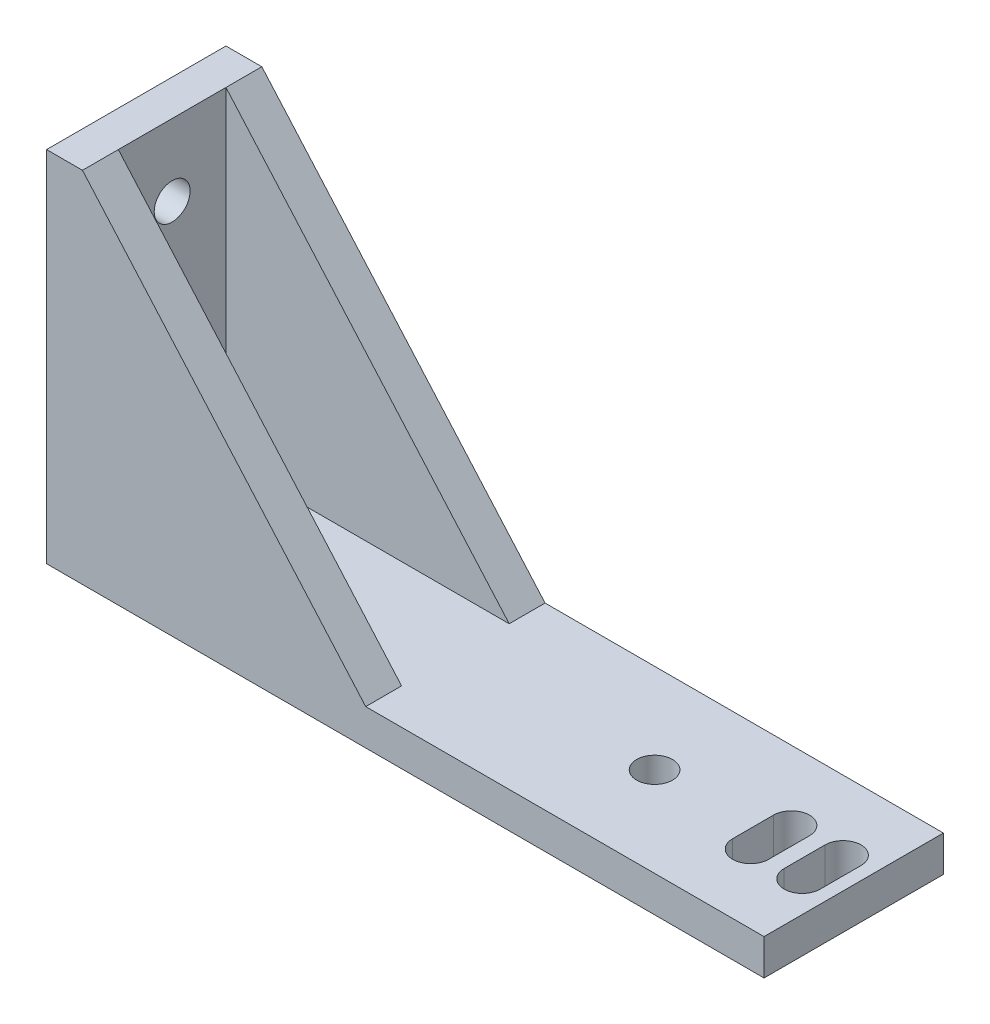
ISO-10303-21;
HEADER;
FILE_DESCRIPTION(('STEP AP214'),'2;1');
FILE_NAME('part.step','',(''),(''),'','','');
FILE_SCHEMA(('AUTOMOTIVE_DESIGN { 1 0 10303 214 1 1 1 1 }'));
ENDSEC;
DATA;
#1=APPLICATION_CONTEXT('core data for automotive mechanical design processes');
#2=APPLICATION_PROTOCOL_DEFINITION('international standard','automotive_design',2000,#1);
#3=PRODUCT_CONTEXT('',#1,'mechanical');
#4=PRODUCT('Part','Part','',(#3));
#5=PRODUCT_RELATED_PRODUCT_CATEGORY('part','',(#4));
#6=PRODUCT_DEFINITION_FORMATION('','',#4);
#7=PRODUCT_DEFINITION_CONTEXT('part definition',#1,'design');
#8=PRODUCT_DEFINITION('design','',#6,#7);
#9=PRODUCT_DEFINITION_SHAPE('','',#8);
#10=(LENGTH_UNIT() NAMED_UNIT(*) SI_UNIT(.MILLI.,.METRE.));
#11=(NAMED_UNIT(*) PLANE_ANGLE_UNIT() SI_UNIT($,.RADIAN.));
#12=(NAMED_UNIT(*) SI_UNIT($,.STERADIAN.) SOLID_ANGLE_UNIT());
#13=UNCERTAINTY_MEASURE_WITH_UNIT(LENGTH_MEASURE(1.E-05),#10,'distance_accuracy_value','');
#14=(GEOMETRIC_REPRESENTATION_CONTEXT(3) GLOBAL_UNCERTAINTY_ASSIGNED_CONTEXT((#13)) GLOBAL_UNIT_ASSIGNED_CONTEXT((#10,
#11,#12)) REPRESENTATION_CONTEXT('',''));
#15=CARTESIAN_POINT('',(0.,0.,0.));
#16=DIRECTION('',(0.,0.,1.));
#17=DIRECTION('',(1.,0.,0.));
#18=AXIS2_PLACEMENT_3D('',#15,#16,#17);
#19=CARTESIAN_POINT('',(0.,0.,0.));
#20=DIRECTION('',(0.,1.,0.));
#21=DIRECTION('',(0.,0.,1.));
#22=AXIS2_PLACEMENT_3D('',#19,#20,#21);
#23=PLANE('',#22);
#24=DIRECTION('',(0.,0.,1.));
#25=VECTOR('',#24,1.);
#26=CARTESIAN_POINT('',(-53.3411919695212,0.,-17.033232323834));
#27=LINE('',#26,#25);
#28=CARTESIAN_POINT('',(-53.3411919695212,0.,-22.033232323834));
#29=VERTEX_POINT('',#28);
#30=CARTESIAN_POINT('',(-53.3411919695212,0.,2.96676767616603));
#31=VERTEX_POINT('',#30);
#32=EDGE_CURVE('E483',#29,#31,#27,.T.);
#33=ORIENTED_EDGE('',*,*,#32,.F.);
#34=DIRECTION('',(1.,0.,0.));
#35=VECTOR('',#34,1.);
#36=CARTESIAN_POINT('',(0.,0.,-22.033232323834));
#37=LINE('',#36,#35);
#38=CARTESIAN_POINT('',(46.6588080304788,0.,-22.033232323834));
#39=VERTEX_POINT('',#38);
#40=EDGE_CURVE('E453',#29,#39,#37,.T.);
#41=ORIENTED_EDGE('',*,*,#40,.T.);
#42=DIRECTION('',(0.,0.,-1.));
#43=VECTOR('',#42,1.);
#44=CARTESIAN_POINT('',(46.6588080304788,0.,-17.033232323834));
#45=LINE('',#44,#43);
#46=CARTESIAN_POINT('',(46.6588080304788,0.,2.96676767616603));
#47=VERTEX_POINT('',#46);
#48=EDGE_CURVE('E489',#47,#39,#45,.T.);
#49=ORIENTED_EDGE('',*,*,#48,.F.);
#50=DIRECTION('',(-1.,0.,0.));
#51=VECTOR('',#50,1.);
#52=CARTESIAN_POINT('',(0.,0.,2.96676767616603));
#53=LINE('',#52,#51);
#54=EDGE_CURVE('E437',#47,#31,#53,.T.);
#55=ORIENTED_EDGE('',*,*,#54,.T.);
#56=EDGE_LOOP('',(#33,#41,#49,#55));
#57=FACE_BOUND('',#56,.T.);
#58=CARTESIAN_POINT('',(18.8988080304788,0.,-9.53323232383397));
#59=DIRECTION('',(0.,1.,0.));
#60=DIRECTION('',(0.,0.,1.));
#61=AXIS2_PLACEMENT_3D('',#58,#59,#60);
#62=CIRCLE('',#61,2.49999999999999);
#63=CARTESIAN_POINT('',(18.8988080304788,0.,-7.03323232383398));
#64=VERTEX_POINT('',#63);
#65=EDGE_CURVE('E364',#64,#64,#62,.T.);
#66=ORIENTED_EDGE('',*,*,#65,.T.);
#67=EDGE_LOOP('',(#66));
#68=FACE_BOUND('',#67,.T.);
#69=CARTESIAN_POINT('',(42.3428128183478,0.,-12.3591779417885));
#70=DIRECTION('',(0.,1.,0.));
#71=DIRECTION('',(0.,0.,1.));
#72=AXIS2_PLACEMENT_3D('',#69,#70,#71);
#73=CIRCLE('',#72,2.5);
#74=CARTESIAN_POINT('',(44.8428128183478,0.,-12.3591779417885));
#75=VERTEX_POINT('',#74);
#76=CARTESIAN_POINT('',(39.8428128183478,0.,-12.3591779417885));
#77=VERTEX_POINT('',#76);
#78=EDGE_CURVE('E507',#75,#77,#73,.T.);
#79=ORIENTED_EDGE('',*,*,#78,.T.);
#80=DIRECTION('',(0.,0.,1.));
#81=VECTOR('',#80,1.);
#82=CARTESIAN_POINT('',(39.8428128183478,0.,0.));
#83=LINE('',#82,#81);
#84=CARTESIAN_POINT('',(39.8428128183478,0.,-6.65917794178849));
#85=VERTEX_POINT('',#84);
#86=EDGE_CURVE('E511',#77,#85,#83,.T.);
#87=ORIENTED_EDGE('',*,*,#86,.T.);
#88=CARTESIAN_POINT('',(42.3428128183478,0.,-6.65917794178849));
#89=DIRECTION('',(0.,1.,0.));
#90=DIRECTION('',(0.,0.,1.));
#91=AXIS2_PLACEMENT_3D('',#88,#89,#90);
#92=CIRCLE('',#91,2.5);
#93=CARTESIAN_POINT('',(44.8428128183478,0.,-6.65917794178849));
#94=VERTEX_POINT('',#93);
#95=EDGE_CURVE('E503',#85,#94,#92,.T.);
#96=ORIENTED_EDGE('',*,*,#95,.T.);
#97=DIRECTION('',(0.,0.,-1.));
#98=VECTOR('',#97,1.);
#99=CARTESIAN_POINT('',(44.8428128183478,0.,-1.09178779122557E-13));
#100=LINE('',#99,#98);
#101=EDGE_CURVE('E495',#94,#75,#100,.T.);
#102=ORIENTED_EDGE('',*,*,#101,.T.);
#103=EDGE_LOOP('',(#79,#87,#96,#102));
#104=FACE_BOUND('',#103,.T.);
#105=DIRECTION('',(0.,0.,-1.));
#106=VECTOR('',#105,1.);
#107=CARTESIAN_POINT('',(32.6546149792119,0.,-6.66475158001632));
#108=LINE('',#107,#106);
#109=CARTESIAN_POINT('',(32.654614979212,0.,-6.66475158001632));
#110=VERTEX_POINT('',#109);
#111=CARTESIAN_POINT('',(32.654614979212,0.,-12.3647515800163));
#112=VERTEX_POINT('',#111);
#113=EDGE_CURVE('E384',#110,#112,#108,.T.);
#114=ORIENTED_EDGE('',*,*,#113,.F.);
#115=CARTESIAN_POINT('',(35.154614979212,0.,-6.66475158001631));
#116=DIRECTION('',(0.,-1.,0.));
#117=DIRECTION('',(0.,0.,-1.));
#118=AXIS2_PLACEMENT_3D('',#115,#116,#117);
#119=CIRCLE('',#118,2.49999999999999);
#120=CARTESIAN_POINT('',(37.6546149792119,0.,-6.66475158001631));
#121=VERTEX_POINT('',#120);
#122=EDGE_CURVE('E393',#121,#110,#119,.T.);
#123=ORIENTED_EDGE('',*,*,#122,.F.);
#124=DIRECTION('',(0.,0.,-1.));
#125=VECTOR('',#124,1.);
#126=CARTESIAN_POINT('',(37.6546149792119,0.,-6.66475158001631));
#127=LINE('',#126,#125);
#128=CARTESIAN_POINT('',(37.654614979212,0.,-12.3647515800163));
#129=VERTEX_POINT('',#128);
#130=EDGE_CURVE('E387',#121,#129,#127,.T.);
#131=ORIENTED_EDGE('',*,*,#130,.T.);
#132=CARTESIAN_POINT('',(35.154614979212,0.,-12.3647515800163));
#133=DIRECTION('',(0.,-1.,0.));
#134=DIRECTION('',(0.,0.,-1.));
#135=AXIS2_PLACEMENT_3D('',#132,#133,#134);
#136=CIRCLE('',#135,2.49999999999999);
#137=EDGE_CURVE('E402',#112,#129,#136,.T.);
#138=ORIENTED_EDGE('',*,*,#137,.F.);
#139=EDGE_LOOP('',(#114,#123,#131,#138));
#140=FACE_BOUND('',#139,.T.);
#141=ADVANCED_FACE('F189',(#57,#68,#104,#140),#23,.F.);
#142=CARTESIAN_POINT('',(0.,5.,0.));
#143=DIRECTION('',(0.,1.,0.));
#144=DIRECTION('',(0.,0.,1.));
#145=AXIS2_PLACEMENT_3D('',#142,#143,#144);
#146=PLANE('',#145);
#147=CARTESIAN_POINT('',(18.8988080304788,5.,-9.53323232383397));
#148=DIRECTION('',(0.,1.,0.));
#149=DIRECTION('',(0.,0.,1.));
#150=AXIS2_PLACEMENT_3D('',#147,#148,#149);
#151=CIRCLE('',#150,2.49999999999999);
#152=CARTESIAN_POINT('',(18.8988080304788,5.,-7.03323232383398));
#153=VERTEX_POINT('',#152);
#154=EDGE_CURVE('E360',#153,#153,#151,.T.);
#155=ORIENTED_EDGE('',*,*,#154,.F.);
#156=EDGE_LOOP('',(#155));
#157=FACE_BOUND('',#156,.T.);
#158=DIRECTION('',(0.,0.,-1.));
#159=VECTOR('',#158,1.);
#160=CARTESIAN_POINT('',(44.8428128183478,5.,-6.6591779417885));
#161=LINE('',#160,#159);
#162=CARTESIAN_POINT('',(44.8428128183478,5.,-6.65917794178849));
#163=VERTEX_POINT('',#162);
#164=CARTESIAN_POINT('',(44.8428128183478,5.,-12.3591779417885));
#165=VERTEX_POINT('',#164);
#166=EDGE_CURVE('E409',#163,#165,#161,.T.);
#167=ORIENTED_EDGE('',*,*,#166,.F.);
#168=CARTESIAN_POINT('',(42.3428128183478,5.,-6.65917794178849));
#169=DIRECTION('',(0.,1.,0.));
#170=DIRECTION('',(0.,0.,1.));
#171=AXIS2_PLACEMENT_3D('',#168,#169,#170);
#172=CIRCLE('',#171,2.49999999999999);
#173=CARTESIAN_POINT('',(39.8428128183477,5.,-6.65917794178849));
#174=VERTEX_POINT('',#173);
#175=EDGE_CURVE('E419',#174,#163,#172,.T.);
#176=ORIENTED_EDGE('',*,*,#175,.F.);
#177=DIRECTION('',(0.,0.,-1.));
#178=VECTOR('',#177,1.);
#179=CARTESIAN_POINT('',(39.8428128183478,5.,-6.65917794178849));
#180=LINE('',#179,#178);
#181=CARTESIAN_POINT('',(39.8428128183478,5.,-12.3591779417885));
#182=VERTEX_POINT('',#181);
#183=EDGE_CURVE('E412',#174,#182,#180,.T.);
#184=ORIENTED_EDGE('',*,*,#183,.T.);
#185=CARTESIAN_POINT('',(42.3428128183478,5.,-12.3591779417885));
#186=DIRECTION('',(0.,1.,0.));
#187=DIRECTION('',(0.,0.,1.));
#188=AXIS2_PLACEMENT_3D('',#185,#186,#187);
#189=CIRCLE('',#188,2.49999999999999);
#190=EDGE_CURVE('E430',#165,#182,#189,.T.);
#191=ORIENTED_EDGE('',*,*,#190,.F.);
#192=EDGE_LOOP('',(#167,#176,#184,#191));
#193=FACE_BOUND('',#192,.T.);
#194=DIRECTION('',(0.,0.,-1.));
#195=VECTOR('',#194,1.);
#196=CARTESIAN_POINT('',(-48.3411919695212,5.,-17.033232323834));
#197=LINE('',#196,#195);
#198=CARTESIAN_POINT('',(-48.3411919695212,5.,-2.03323232383397));
#199=VERTEX_POINT('',#198);
#200=CARTESIAN_POINT('',(-48.3411919695212,5.,-17.033232323834));
#201=VERTEX_POINT('',#200);
#202=EDGE_CURVE('E466',#199,#201,#197,.T.);
#203=ORIENTED_EDGE('',*,*,#202,.F.);
#204=DIRECTION('',(1.,0.,0.));
#205=VECTOR('',#204,1.);
#206=CARTESIAN_POINT('',(-53.3411919695212,5.,-2.03323232383397));
#207=LINE('',#206,#205);
#208=CARTESIAN_POINT('',(-8.86119196952119,5.,-2.03323232383397));
#209=VERTEX_POINT('',#208);
#210=EDGE_CURVE('E484',#199,#209,#207,.T.);
#211=ORIENTED_EDGE('',*,*,#210,.T.);
#212=DIRECTION('',(0.,0.,1.));
#213=VECTOR('',#212,1.);
#214=CARTESIAN_POINT('',(-8.86119196952119,5.,0.));
#215=LINE('',#214,#213);
#216=CARTESIAN_POINT('',(-8.86119196952119,5.,2.96676767616603));
#217=VERTEX_POINT('',#216);
#218=EDGE_CURVE('E442',#209,#217,#215,.T.);
#219=ORIENTED_EDGE('',*,*,#218,.T.);
#220=DIRECTION('',(-1.,0.,0.));
#221=VECTOR('',#220,1.);
#222=CARTESIAN_POINT('',(0.,5.,2.96676767616603));
#223=LINE('',#222,#221);
#224=CARTESIAN_POINT('',(46.6588080304788,5.,2.96676767616603));
#225=VERTEX_POINT('',#224);
#226=EDGE_CURVE('E438',#225,#217,#223,.T.);
#227=ORIENTED_EDGE('',*,*,#226,.F.);
#228=DIRECTION('',(0.,0.,-1.));
#229=VECTOR('',#228,1.);
#230=CARTESIAN_POINT('',(46.6588080304788,5.,-17.033232323834));
#231=LINE('',#230,#229);
#232=CARTESIAN_POINT('',(46.6588080304788,5.,-22.033232323834));
#233=VERTEX_POINT('',#232);
#234=EDGE_CURVE('E488',#225,#233,#231,.T.);
#235=ORIENTED_EDGE('',*,*,#234,.T.);
#236=DIRECTION('',(1.,0.,0.));
#237=VECTOR('',#236,1.);
#238=CARTESIAN_POINT('',(0.,5.,-22.033232323834));
#239=LINE('',#238,#237);
#240=CARTESIAN_POINT('',(-8.86119196952119,5.,-22.033232323834));
#241=VERTEX_POINT('',#240);
#242=EDGE_CURVE('E454',#241,#233,#239,.T.);
#243=ORIENTED_EDGE('',*,*,#242,.F.);
#244=DIRECTION('',(0.,0.,-1.));
#245=VECTOR('',#244,1.);
#246=CARTESIAN_POINT('',(-8.86119196952118,5.,0.));
#247=LINE('',#246,#245);
#248=CARTESIAN_POINT('',(-8.86119196952119,5.,-17.033232323834));
#249=VERTEX_POINT('',#248);
#250=EDGE_CURVE('E315',#249,#241,#247,.T.);
#251=ORIENTED_EDGE('',*,*,#250,.F.);
#252=DIRECTION('',(-1.,0.,0.));
#253=VECTOR('',#252,1.);
#254=CARTESIAN_POINT('',(-53.3411919695212,5.,-17.033232323834));
#255=LINE('',#254,#253);
#256=EDGE_CURVE('E492',#249,#201,#255,.T.);
#257=ORIENTED_EDGE('',*,*,#256,.T.);
#258=EDGE_LOOP('',(#203,#211,#219,#227,#235,#243,#251,#257));
#259=FACE_BOUND('',#258,.T.);
#260=CARTESIAN_POINT('',(35.154614979212,5.,-12.3647515800163));
#261=DIRECTION('',(0.,1.,0.));
#262=DIRECTION('',(0.,0.,1.));
#263=AXIS2_PLACEMENT_3D('',#260,#261,#262);
#264=CIRCLE('',#263,2.5);
#265=CARTESIAN_POINT('',(37.654614979212,5.,-12.3647515800163));
#266=VERTEX_POINT('',#265);
#267=CARTESIAN_POINT('',(32.654614979212,5.,-12.3647515800163));
#268=VERTEX_POINT('',#267);
#269=EDGE_CURVE('E198',#266,#268,#264,.T.);
#270=ORIENTED_EDGE('',*,*,#269,.F.);
#271=DIRECTION('',(0.,0.,1.));
#272=VECTOR('',#271,1.);
#273=CARTESIAN_POINT('',(37.6546149792119,5.,0.));
#274=LINE('',#273,#272);
#275=CARTESIAN_POINT('',(37.654614979212,5.,-6.66475158001631));
#276=VERTEX_POINT('',#275);
#277=EDGE_CURVE('E13',#266,#276,#274,.T.);
#278=ORIENTED_EDGE('',*,*,#277,.T.);
#279=CARTESIAN_POINT('',(35.154614979212,5.,-6.66475158001631));
#280=DIRECTION('',(0.,1.,0.));
#281=DIRECTION('',(0.,0.,1.));
#282=AXIS2_PLACEMENT_3D('',#279,#280,#281);
#283=CIRCLE('',#282,2.5);
#284=CARTESIAN_POINT('',(32.654614979212,5.,-6.66475158001632));
#285=VERTEX_POINT('',#284);
#286=EDGE_CURVE('E518',#285,#276,#283,.T.);
#287=ORIENTED_EDGE('',*,*,#286,.F.);
#288=DIRECTION('',(0.,0.,1.));
#289=VECTOR('',#288,1.);
#290=CARTESIAN_POINT('',(32.6546149792119,5.,0.));
#291=LINE('',#290,#289);
#292=EDGE_CURVE('E515',#268,#285,#291,.T.);
#293=ORIENTED_EDGE('',*,*,#292,.F.);
#294=EDGE_LOOP('',(#270,#278,#287,#293));
#295=FACE_BOUND('',#294,.T.);
#296=ADVANCED_FACE('F533',(#157,#193,#259,#295),#146,.T.);
#297=CARTESIAN_POINT('',(-53.3411919695212,5.,-17.033232323834));
#298=DIRECTION('',(1.,0.,0.));
#299=DIRECTION('',(0.,0.,-1.));
#300=AXIS2_PLACEMENT_3D('',#297,#298,#299);
#301=PLANE('',#300);
#302=CARTESIAN_POINT('',(-53.3411919695212,40.,-9.53323232383397));
#303=DIRECTION('',(-1.,0.,0.));
#304=DIRECTION('',(0.,0.,1.));
#305=AXIS2_PLACEMENT_3D('',#302,#303,#304);
#306=CIRCLE('',#305,2.49999999999999);
#307=CARTESIAN_POINT('',(-53.3411919695212,40.,-7.03323232383398));
#308=VERTEX_POINT('',#307);
#309=EDGE_CURVE('E368',#308,#308,#306,.T.);
#310=ORIENTED_EDGE('',*,*,#309,.F.);
#311=EDGE_LOOP('',(#310));
#312=FACE_BOUND('',#311,.T.);
#313=CARTESIAN_POINT('',(-53.3411919695212,14.9999999999998,-9.95857778879027));
#314=DIRECTION('',(-1.,0.,0.));
#315=DIRECTION('',(0.,0.,1.));
#316=AXIS2_PLACEMENT_3D('',#313,#314,#315);
#317=CIRCLE('',#316,2.49999999999999);
#318=CARTESIAN_POINT('',(-53.3411919695212,14.9999999999998,-7.45857778879028));
#319=VERTEX_POINT('',#318);
#320=EDGE_CURVE('E376',#319,#319,#317,.T.);
#321=ORIENTED_EDGE('',*,*,#320,.F.);
#322=EDGE_LOOP('',(#321));
#323=FACE_BOUND('',#322,.T.);
#324=ORIENTED_EDGE('',*,*,#32,.T.);
#325=DIRECTION('',(0.,-1.,0.));
#326=VECTOR('',#325,1.);
#327=CARTESIAN_POINT('',(-53.3411919695212,0.,2.96676767616603));
#328=LINE('',#327,#326);
#329=CARTESIAN_POINT('',(-53.3411919695212,50.,2.96676767616603));
#330=VERTEX_POINT('',#329);
#331=EDGE_CURVE('E350',#330,#31,#328,.T.);
#332=ORIENTED_EDGE('',*,*,#331,.F.);
#333=DIRECTION('',(0.,0.,1.));
#334=VECTOR('',#333,1.);
#335=CARTESIAN_POINT('',(-53.3411919695212,50.,-17.033232323834));
#336=LINE('',#335,#334);
#337=CARTESIAN_POINT('',(-53.3411919695212,50.,-22.033232323834));
#338=VERTEX_POINT('',#337);
#339=EDGE_CURVE('E467',#338,#330,#336,.T.);
#340=ORIENTED_EDGE('',*,*,#339,.F.);
#341=DIRECTION('',(0.,1.,0.));
#342=VECTOR('',#341,1.);
#343=CARTESIAN_POINT('',(-53.3411919695212,0.,-22.033232323834));
#344=LINE('',#343,#342);
#345=EDGE_CURVE('E319',#29,#338,#344,.T.);
#346=ORIENTED_EDGE('',*,*,#345,.F.);
#347=EDGE_LOOP('',(#324,#332,#340,#346));
#348=FACE_BOUND('',#347,.T.);
#349=ADVANCED_FACE('F191',(#312,#323,#348),#301,.F.);
#350=CARTESIAN_POINT('',(46.6588080304788,5.,-17.033232323834));
#351=DIRECTION('',(-1.,0.,0.));
#352=DIRECTION('',(0.,0.,1.));
#353=AXIS2_PLACEMENT_3D('',#350,#351,#352);
#354=PLANE('',#353);
#355=ORIENTED_EDGE('',*,*,#48,.T.);
#356=DIRECTION('',(0.,-1.,0.));
#357=VECTOR('',#356,1.);
#358=CARTESIAN_POINT('',(46.6588080304788,5.,-22.033232323834));
#359=LINE('',#358,#357);
#360=EDGE_CURVE('E459',#233,#39,#359,.T.);
#361=ORIENTED_EDGE('',*,*,#360,.F.);
#362=ORIENTED_EDGE('',*,*,#234,.F.);
#363=DIRECTION('',(0.,-1.,0.));
#364=VECTOR('',#363,1.);
#365=CARTESIAN_POINT('',(46.6588080304788,5.,2.96676767616603));
#366=LINE('',#365,#364);
#367=EDGE_CURVE('E446',#225,#47,#366,.T.);
#368=ORIENTED_EDGE('',*,*,#367,.T.);
#369=EDGE_LOOP('',(#355,#361,#362,#368));
#370=FACE_BOUND('',#369,.T.);
#371=ADVANCED_FACE('F549',(#370),#354,.F.);
#372=CARTESIAN_POINT('',(-48.3411919695212,50.,-17.033232323834));
#373=DIRECTION('',(-1.,0.,0.));
#374=DIRECTION('',(0.,0.,1.));
#375=AXIS2_PLACEMENT_3D('',#372,#373,#374);
#376=PLANE('',#375);
#377=CARTESIAN_POINT('',(-48.3411919695212,40.,-9.53323232383397));
#378=DIRECTION('',(-1.,0.,0.));
#379=DIRECTION('',(0.,0.,1.));
#380=AXIS2_PLACEMENT_3D('',#377,#378,#379);
#381=CIRCLE('',#380,2.5);
#382=CARTESIAN_POINT('',(-48.3411919695212,40.,-7.03323232383397));
#383=VERTEX_POINT('',#382);
#384=EDGE_CURVE('E372',#383,#383,#381,.T.);
#385=ORIENTED_EDGE('',*,*,#384,.T.);
#386=EDGE_LOOP('',(#385));
#387=FACE_BOUND('',#386,.T.);
#388=CARTESIAN_POINT('',(-48.3411919695212,14.9999999999998,-9.95857778879027));
#389=DIRECTION('',(-1.,0.,0.));
#390=DIRECTION('',(0.,0.,1.));
#391=AXIS2_PLACEMENT_3D('',#388,#389,#390);
#392=CIRCLE('',#391,2.49999999999999);
#393=CARTESIAN_POINT('',(-48.3411919695212,14.9999999999998,-7.45857778879028));
#394=VERTEX_POINT('',#393);
#395=EDGE_CURVE('E380',#394,#394,#392,.T.);
#396=ORIENTED_EDGE('',*,*,#395,.T.);
#397=EDGE_LOOP('',(#396));
#398=FACE_BOUND('',#397,.T.);
#399=ORIENTED_EDGE('',*,*,#202,.T.);
#400=DIRECTION('',(0.,-1.,0.));
#401=VECTOR('',#400,1.);
#402=CARTESIAN_POINT('',(-48.3411919695212,50.,-17.033232323834));
#403=LINE('',#402,#401);
#404=CARTESIAN_POINT('',(-48.3411919695212,50.,-17.033232323834));
#405=VERTEX_POINT('',#404);
#406=EDGE_CURVE('E472',#405,#201,#403,.T.);
#407=ORIENTED_EDGE('',*,*,#406,.F.);
#408=DIRECTION('',(0.,0.,-1.));
#409=VECTOR('',#408,1.);
#410=CARTESIAN_POINT('',(-48.3411919695212,50.,-17.033232323834));
#411=LINE('',#410,#409);
#412=CARTESIAN_POINT('',(-48.3411919695212,50.,-2.03323232383397));
#413=VERTEX_POINT('',#412);
#414=EDGE_CURVE('E334',#413,#405,#411,.T.);
#415=ORIENTED_EDGE('',*,*,#414,.F.);
#416=DIRECTION('',(0.,-1.,0.));
#417=VECTOR('',#416,1.);
#418=CARTESIAN_POINT('',(-48.3411919695212,50.,-2.03323232383397));
#419=LINE('',#418,#417);
#420=EDGE_CURVE('E479',#413,#199,#419,.T.);
#421=ORIENTED_EDGE('',*,*,#420,.T.);
#422=EDGE_LOOP('',(#399,#407,#415,#421));
#423=FACE_BOUND('',#422,.T.);
#424=ADVANCED_FACE('F551',(#387,#398,#423),#376,.F.);
#425=CARTESIAN_POINT('',(0.,50.,0.));
#426=DIRECTION('',(0.,1.,0.));
#427=DIRECTION('',(0.,0.,1.));
#428=AXIS2_PLACEMENT_3D('',#425,#426,#427);
#429=PLANE('',#428);
#430=ORIENTED_EDGE('',*,*,#339,.T.);
#431=DIRECTION('',(-1.,0.,0.));
#432=VECTOR('',#431,1.);
#433=CARTESIAN_POINT('',(-53.3411919695212,50.,2.96676767616603));
#434=LINE('',#433,#432);
#435=CARTESIAN_POINT('',(-48.3411919695212,50.,2.96676767616603));
#436=VERTEX_POINT('',#435);
#437=EDGE_CURVE('E342',#436,#330,#434,.T.);
#438=ORIENTED_EDGE('',*,*,#437,.F.);
#439=DIRECTION('',(0.,0.,-1.));
#440=VECTOR('',#439,1.);
#441=CARTESIAN_POINT('',(-48.3411919695212,50.,2.96676767616603));
#442=LINE('',#441,#440);
#443=EDGE_CURVE('E356',#436,#413,#442,.T.);
#444=ORIENTED_EDGE('',*,*,#443,.T.);
#445=ORIENTED_EDGE('',*,*,#414,.T.);
#446=DIRECTION('',(0.,0.,1.));
#447=VECTOR('',#446,1.);
#448=CARTESIAN_POINT('',(-48.3411919695212,50.,-22.033232323834));
#449=LINE('',#448,#447);
#450=CARTESIAN_POINT('',(-48.3411919695212,50.,-22.033232323834));
#451=VERTEX_POINT('',#450);
#452=EDGE_CURVE('E314',#451,#405,#449,.T.);
#453=ORIENTED_EDGE('',*,*,#452,.F.);
#454=DIRECTION('',(1.,0.,0.));
#455=VECTOR('',#454,1.);
#456=CARTESIAN_POINT('',(-53.3411919695212,50.,-22.033232323834));
#457=LINE('',#456,#455);
#458=EDGE_CURVE('E320',#338,#451,#457,.T.);
#459=ORIENTED_EDGE('',*,*,#458,.F.);
#460=EDGE_LOOP('',(#430,#438,#444,#445,#453,#459));
#461=FACE_BOUND('',#460,.T.);
#462=ADVANCED_FACE('F331',(#461),#429,.T.);
#463=CARTESIAN_POINT('',(0.,5.,-22.033232323834));
#464=DIRECTION('',(0.,0.,-1.));
#465=DIRECTION('',(-1.,0.,0.));
#466=AXIS2_PLACEMENT_3D('',#463,#464,#465);
#467=PLANE('',#466);
#468=ORIENTED_EDGE('',*,*,#40,.F.);
#469=ORIENTED_EDGE('',*,*,#345,.T.);
#470=ORIENTED_EDGE('',*,*,#458,.T.);
#471=DIRECTION('',(0.659497440221656,-0.751706808763286,0.));
#472=VECTOR('',#471,1.);
#473=CARTESIAN_POINT('',(-48.3411919695212,50.,-22.033232323834));
#474=LINE('',#473,#472);
#475=EDGE_CURVE('E309',#451,#241,#474,.T.);
#476=ORIENTED_EDGE('',*,*,#475,.T.);
#477=ORIENTED_EDGE('',*,*,#242,.T.);
#478=ORIENTED_EDGE('',*,*,#360,.T.);
#479=EDGE_LOOP('',(#468,#469,#470,#476,#477,#478));
#480=FACE_BOUND('',#479,.T.);
#481=ADVANCED_FACE('F325',(#480),#467,.T.);
#482=CARTESIAN_POINT('',(0.,5.,2.96676767616603));
#483=DIRECTION('',(0.,0.,1.));
#484=DIRECTION('',(1.,0.,0.));
#485=AXIS2_PLACEMENT_3D('',#482,#483,#484);
#486=PLANE('',#485);
#487=ORIENTED_EDGE('',*,*,#54,.F.);
#488=ORIENTED_EDGE('',*,*,#367,.F.);
#489=ORIENTED_EDGE('',*,*,#226,.T.);
#490=DIRECTION('',(-0.659497440221656,0.751706808763286,0.));
#491=VECTOR('',#490,1.);
#492=CARTESIAN_POINT('',(-48.3411919695212,50.,2.96676767616603));
#493=LINE('',#492,#491);
#494=EDGE_CURVE('E354',#217,#436,#493,.T.);
#495=ORIENTED_EDGE('',*,*,#494,.T.);
#496=ORIENTED_EDGE('',*,*,#437,.T.);
#497=ORIENTED_EDGE('',*,*,#331,.T.);
#498=EDGE_LOOP('',(#487,#488,#489,#495,#496,#497));
#499=FACE_BOUND('',#498,.T.);
#500=ADVANCED_FACE('F567',(#499),#486,.T.);
#501=CARTESIAN_POINT('',(42.3428128183478,5.,-12.3591779417885));
#502=DIRECTION('',(0.,1.,0.));
#503=DIRECTION('',(0.,0.,1.));
#504=AXIS2_PLACEMENT_3D('',#501,#502,#503);
#505=CYLINDRICAL_SURFACE('',#504,2.5);
#506=DIRECTION('',(0.,-1.,0.));
#507=VECTOR('',#506,1.);
#508=CARTESIAN_POINT('',(44.8428128183478,-0.00100000000000013,-12.3591779417885));
#509=LINE('',#508,#507);
#510=EDGE_CURVE('E426',#165,#75,#509,.T.);
#511=ORIENTED_EDGE('',*,*,#510,.F.);
#512=ORIENTED_EDGE('',*,*,#190,.T.);
#513=DIRECTION('',(0.,1.,0.));
#514=VECTOR('',#513,1.);
#515=CARTESIAN_POINT('',(39.8428128183478,5.,-12.3591779417885));
#516=LINE('',#515,#514);
#517=EDGE_CURVE('E434',#77,#182,#516,.T.);
#518=ORIENTED_EDGE('',*,*,#517,.F.);
#519=ORIENTED_EDGE('',*,*,#78,.F.);
#520=EDGE_LOOP('',(#511,#512,#518,#519));
#521=FACE_BOUND('',#520,.T.);
#522=ADVANCED_FACE('F624',(#521),#505,.F.);
#523=CARTESIAN_POINT('',(42.3428128183478,5.,-6.65917794178849));
#524=DIRECTION('',(0.,1.,0.));
#525=DIRECTION('',(0.,0.,1.));
#526=AXIS2_PLACEMENT_3D('',#523,#524,#525);
#527=CYLINDRICAL_SURFACE('',#526,2.5);
#528=DIRECTION('',(0.,1.,0.));
#529=VECTOR('',#528,1.);
#530=CARTESIAN_POINT('',(39.8428128183478,5.,-6.65917794178849));
#531=LINE('',#530,#529);
#532=EDGE_CURVE('E422',#174,#85,#531,.F.);
#533=ORIENTED_EDGE('',*,*,#532,.F.);
#534=ORIENTED_EDGE('',*,*,#175,.T.);
#535=DIRECTION('',(0.,-1.,0.));
#536=VECTOR('',#535,1.);
#537=CARTESIAN_POINT('',(44.8428128183478,-0.00100000000000013,-6.65917794178849));
#538=LINE('',#537,#536);
#539=EDGE_CURVE('E416',#163,#94,#538,.T.);
#540=ORIENTED_EDGE('',*,*,#539,.T.);
#541=ORIENTED_EDGE('',*,*,#95,.F.);
#542=EDGE_LOOP('',(#533,#534,#540,#541));
#543=FACE_BOUND('',#542,.T.);
#544=ADVANCED_FACE('F620',(#543),#527,.F.);
#545=CARTESIAN_POINT('',(39.8428128183478,5.,-6.65917794178849));
#546=DIRECTION('',(-1.,0.,0.));
#547=DIRECTION('',(0.,0.,1.));
#548=AXIS2_PLACEMENT_3D('',#545,#546,#547);
#549=PLANE('',#548);
#550=ORIENTED_EDGE('',*,*,#517,.T.);
#551=ORIENTED_EDGE('',*,*,#183,.F.);
#552=ORIENTED_EDGE('',*,*,#532,.T.);
#553=ORIENTED_EDGE('',*,*,#86,.F.);
#554=EDGE_LOOP('',(#550,#551,#552,#553));
#555=FACE_BOUND('',#554,.T.);
#556=ADVANCED_FACE('F616',(#555),#549,.F.);
#557=CARTESIAN_POINT('',(44.8428128183478,-0.00100000000000013,-6.65917794178849));
#558=DIRECTION('',(1.,0.,0.));
#559=DIRECTION('',(0.,0.,-1.));
#560=AXIS2_PLACEMENT_3D('',#557,#558,#559);
#561=PLANE('',#560);
#562=ORIENTED_EDGE('',*,*,#539,.F.);
#563=ORIENTED_EDGE('',*,*,#166,.T.);
#564=ORIENTED_EDGE('',*,*,#510,.T.);
#565=ORIENTED_EDGE('',*,*,#101,.F.);
#566=EDGE_LOOP('',(#562,#563,#564,#565));
#567=FACE_BOUND('',#566,.T.);
#568=ADVANCED_FACE('F613',(#567),#561,.F.);
#569=CARTESIAN_POINT('',(35.154614979212,0.,-12.3647515800163));
#570=DIRECTION('',(0.,-1.,0.));
#571=DIRECTION('',(0.,0.,-1.));
#572=AXIS2_PLACEMENT_3D('',#569,#570,#571);
#573=CYLINDRICAL_SURFACE('',#572,2.5);
#574=ORIENTED_EDGE('',*,*,#269,.T.);
#575=DIRECTION('',(0.,-1.,0.));
#576=VECTOR('',#575,1.);
#577=CARTESIAN_POINT('',(32.654614979212,0.,-12.3647515800163));
#578=LINE('',#577,#576);
#579=EDGE_CURVE('E405',#112,#268,#578,.F.);
#580=ORIENTED_EDGE('',*,*,#579,.F.);
#581=ORIENTED_EDGE('',*,*,#137,.T.);
#582=DIRECTION('',(0.,1.,0.));
#583=VECTOR('',#582,1.);
#584=CARTESIAN_POINT('',(37.654614979212,5.001,-12.3647515800163));
#585=LINE('',#584,#583);
#586=EDGE_CURVE('E398',#129,#266,#585,.T.);
#587=ORIENTED_EDGE('',*,*,#586,.T.);
#588=EDGE_LOOP('',(#574,#580,#581,#587));
#589=FACE_BOUND('',#588,.T.);
#590=ADVANCED_FACE('F524',(#589),#573,.F.);
#591=CARTESIAN_POINT('',(35.154614979212,0.,-6.66475158001631));
#592=DIRECTION('',(0.,-1.,0.));
#593=DIRECTION('',(0.,0.,-1.));
#594=AXIS2_PLACEMENT_3D('',#591,#592,#593);
#595=CYLINDRICAL_SURFACE('',#594,2.5);
#596=ORIENTED_EDGE('',*,*,#286,.T.);
#597=DIRECTION('',(0.,1.,0.));
#598=VECTOR('',#597,1.);
#599=CARTESIAN_POINT('',(37.654614979212,5.001,-6.66475158001631));
#600=LINE('',#599,#598);
#601=EDGE_CURVE('E205',#121,#276,#600,.T.);
#602=ORIENTED_EDGE('',*,*,#601,.F.);
#603=ORIENTED_EDGE('',*,*,#122,.T.);
#604=DIRECTION('',(0.,-1.,0.));
#605=VECTOR('',#604,1.);
#606=CARTESIAN_POINT('',(32.654614979212,0.,-6.66475158001632));
#607=LINE('',#606,#605);
#608=EDGE_CURVE('E210',#285,#110,#607,.T.);
#609=ORIENTED_EDGE('',*,*,#608,.F.);
#610=EDGE_LOOP('',(#596,#602,#603,#609));
#611=FACE_BOUND('',#610,.T.);
#612=ADVANCED_FACE('F534',(#611),#595,.F.);
#613=CARTESIAN_POINT('',(37.654614979212,5.001,-6.66475158001631));
#614=DIRECTION('',(-1.,0.,0.));
#615=DIRECTION('',(0.,0.,1.));
#616=AXIS2_PLACEMENT_3D('',#613,#614,#615);
#617=PLANE('',#616);
#618=ORIENTED_EDGE('',*,*,#586,.F.);
#619=ORIENTED_EDGE('',*,*,#130,.F.);
#620=ORIENTED_EDGE('',*,*,#601,.T.);
#621=ORIENTED_EDGE('',*,*,#277,.F.);
#622=EDGE_LOOP('',(#618,#619,#620,#621));
#623=FACE_BOUND('',#622,.T.);
#624=ADVANCED_FACE('F536',(#623),#617,.T.);
#625=CARTESIAN_POINT('',(32.654614979212,0.,-6.66475158001632));
#626=DIRECTION('',(-1.,0.,0.));
#627=DIRECTION('',(0.,0.,1.));
#628=AXIS2_PLACEMENT_3D('',#625,#626,#627);
#629=PLANE('',#628);
#630=ORIENTED_EDGE('',*,*,#292,.T.);
#631=ORIENTED_EDGE('',*,*,#608,.T.);
#632=ORIENTED_EDGE('',*,*,#113,.T.);
#633=ORIENTED_EDGE('',*,*,#579,.T.);
#634=EDGE_LOOP('',(#630,#631,#632,#633));
#635=FACE_BOUND('',#634,.T.);
#636=ADVANCED_FACE('F530',(#635),#629,.F.);
#637=CARTESIAN_POINT('',(-53.3411919695212,14.9999999999998,-9.95857778879027));
#638=DIRECTION('',(-1.,0.,0.));
#639=DIRECTION('',(0.,0.,1.));
#640=AXIS2_PLACEMENT_3D('',#637,#638,#639);
#641=CYLINDRICAL_SURFACE('',#640,2.49999999999999);
#642=ORIENTED_EDGE('',*,*,#395,.F.);
#643=EDGE_LOOP('',(#642));
#644=FACE_BOUND('',#643,.T.);
#645=ORIENTED_EDGE('',*,*,#320,.T.);
#646=EDGE_LOOP('',(#645));
#647=FACE_BOUND('',#646,.T.);
#648=ADVANCED_FACE('F600',(#644,#647),#641,.F.);
#649=CARTESIAN_POINT('',(-53.3411919695212,40.,-9.53323232383397));
#650=DIRECTION('',(-1.,0.,0.));
#651=DIRECTION('',(0.,0.,1.));
#652=AXIS2_PLACEMENT_3D('',#649,#650,#651);
#653=CYLINDRICAL_SURFACE('',#652,2.5);
#654=ORIENTED_EDGE('',*,*,#384,.F.);
#655=EDGE_LOOP('',(#654));
#656=FACE_BOUND('',#655,.T.);
#657=ORIENTED_EDGE('',*,*,#309,.T.);
#658=EDGE_LOOP('',(#657));
#659=FACE_BOUND('',#658,.T.);
#660=ADVANCED_FACE('F596',(#656,#659),#653,.F.);
#661=CARTESIAN_POINT('',(18.8988080304788,5.,-9.53323232383397));
#662=DIRECTION('',(0.,1.,0.));
#663=DIRECTION('',(0.,0.,1.));
#664=AXIS2_PLACEMENT_3D('',#661,#662,#663);
#665=CYLINDRICAL_SURFACE('',#664,2.49999999999999);
#666=ORIENTED_EDGE('',*,*,#65,.F.);
#667=EDGE_LOOP('',(#666));
#668=FACE_BOUND('',#667,.T.);
#669=ORIENTED_EDGE('',*,*,#154,.T.);
#670=EDGE_LOOP('',(#669));
#671=FACE_BOUND('',#670,.T.);
#672=ADVANCED_FACE('F593',(#668,#671),#665,.F.);
#673=CARTESIAN_POINT('',(-48.3411919695212,50.,2.96676767616603));
#674=DIRECTION('',(-0.751706808763286,-0.659497440221656,0.));
#675=DIRECTION('',(0.659497440221656,-0.751706808763286,0.));
#676=AXIS2_PLACEMENT_3D('',#673,#674,#675);
#677=PLANE('',#676);
#678=DIRECTION('',(-0.659497440221656,0.751706808763286,0.));
#679=VECTOR('',#678,1.);
#680=CARTESIAN_POINT('',(-48.3411919695212,50.,-2.03323232383397));
#681=LINE('',#680,#679);
#682=EDGE_CURVE('E337',#209,#413,#681,.T.);
#683=ORIENTED_EDGE('',*,*,#682,.T.);
#684=ORIENTED_EDGE('',*,*,#443,.F.);
#685=ORIENTED_EDGE('',*,*,#494,.F.);
#686=ORIENTED_EDGE('',*,*,#218,.F.);
#687=EDGE_LOOP('',(#683,#684,#685,#686));
#688=FACE_BOUND('',#687,.T.);
#689=ADVANCED_FACE('F570',(#688),#677,.F.);
#690=CARTESIAN_POINT('',(0.,0.,-2.03323232383397));
#691=DIRECTION('',(0.,0.,-1.));
#692=DIRECTION('',(-1.,0.,0.));
#693=AXIS2_PLACEMENT_3D('',#690,#691,#692);
#694=PLANE('',#693);
#695=ORIENTED_EDGE('',*,*,#682,.F.);
#696=ORIENTED_EDGE('',*,*,#210,.F.);
#697=ORIENTED_EDGE('',*,*,#420,.F.);
#698=EDGE_LOOP('',(#695,#696,#697));
#699=FACE_BOUND('',#698,.T.);
#700=ADVANCED_FACE('F573',(#699),#694,.T.);
#701=CARTESIAN_POINT('',(-48.3411919695212,50.,-22.033232323834));
#702=DIRECTION('',(-0.751706808763286,-0.659497440221656,0.));
#703=DIRECTION('',(0.659497440221656,-0.751706808763286,0.));
#704=AXIS2_PLACEMENT_3D('',#701,#702,#703);
#705=PLANE('',#704);
#706=DIRECTION('',(0.659497440221656,-0.751706808763286,0.));
#707=VECTOR('',#706,1.);
#708=CARTESIAN_POINT('',(-48.3411919695212,50.,-17.033232323834));
#709=LINE('',#708,#707);
#710=EDGE_CURVE('E329',#405,#249,#709,.T.);
#711=ORIENTED_EDGE('',*,*,#710,.T.);
#712=ORIENTED_EDGE('',*,*,#250,.T.);
#713=ORIENTED_EDGE('',*,*,#475,.F.);
#714=ORIENTED_EDGE('',*,*,#452,.T.);
#715=EDGE_LOOP('',(#711,#712,#713,#714));
#716=FACE_BOUND('',#715,.T.);
#717=ADVANCED_FACE('F312',(#716),#705,.F.);
#718=CARTESIAN_POINT('',(0.,0.,-17.033232323834));
#719=DIRECTION('',(0.,0.,-1.));
#720=DIRECTION('',(-1.,0.,0.));
#721=AXIS2_PLACEMENT_3D('',#718,#719,#720);
#722=PLANE('',#721);
#723=ORIENTED_EDGE('',*,*,#256,.F.);
#724=ORIENTED_EDGE('',*,*,#710,.F.);
#725=ORIENTED_EDGE('',*,*,#406,.T.);
#726=EDGE_LOOP('',(#723,#724,#725));
#727=FACE_BOUND('',#726,.T.);
#728=ADVANCED_FACE('F580',(#727),#722,.F.);
#729=CLOSED_SHELL('',(#141,#296,#349,#371,#424,#462,#481,#500,#522,#544,#556,#568,#590,#612,
#624,#636,#648,#660,#672,#689,#700,#717,#728));
#730=MANIFOLD_SOLID_BREP('B2',#729);
#731=ADVANCED_BREP_SHAPE_REPRESENTATION('',(#18,#730),#14);
#732=SHAPE_DEFINITION_REPRESENTATION(#9,#731);
ENDSEC;
END-ISO-10303-21;
